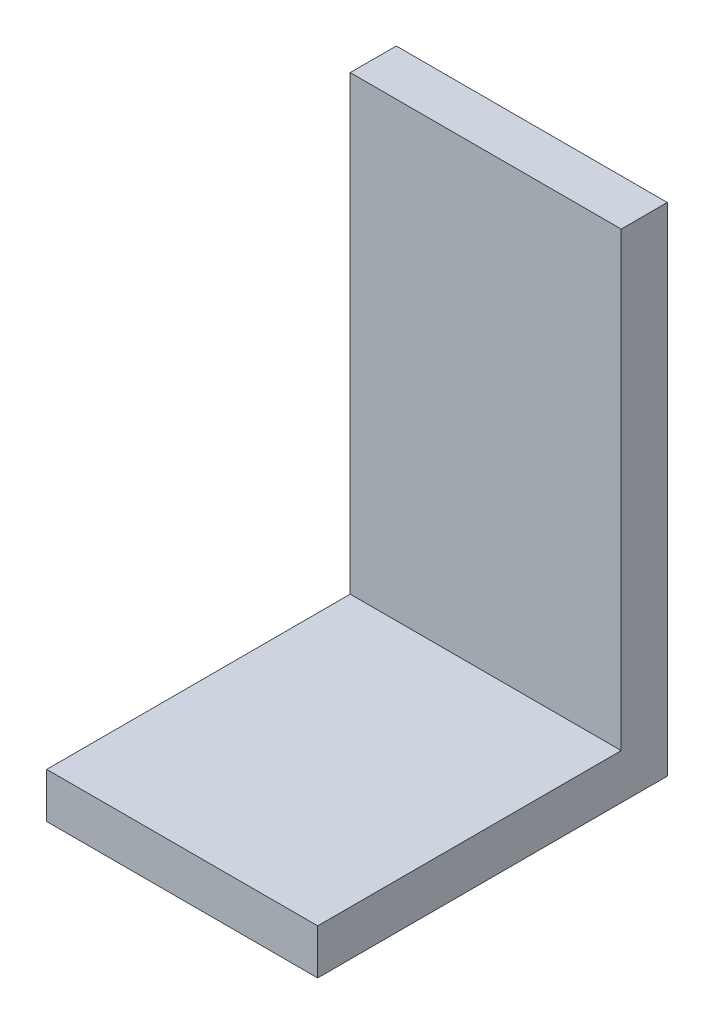
ISO-10303-21;
HEADER;
FILE_DESCRIPTION(('STEP AP214'),'2;1');
FILE_NAME('part.step','',(''),(''),'','','');
FILE_SCHEMA(('AUTOMOTIVE_DESIGN { 1 0 10303 214 1 1 1 1 }'));
ENDSEC;
DATA;
#1=APPLICATION_CONTEXT('core data for automotive mechanical design processes');
#2=APPLICATION_PROTOCOL_DEFINITION('international standard','automotive_design',2000,#1);
#3=PRODUCT_CONTEXT('',#1,'mechanical');
#4=PRODUCT('Part','Part','',(#3));
#5=PRODUCT_RELATED_PRODUCT_CATEGORY('part','',(#4));
#6=PRODUCT_DEFINITION_FORMATION('','',#4);
#7=PRODUCT_DEFINITION_CONTEXT('part definition',#1,'design');
#8=PRODUCT_DEFINITION('design','',#6,#7);
#9=PRODUCT_DEFINITION_SHAPE('','',#8);
#10=(LENGTH_UNIT() NAMED_UNIT(*) SI_UNIT(.MILLI.,.METRE.));
#11=(NAMED_UNIT(*) PLANE_ANGLE_UNIT() SI_UNIT($,.RADIAN.));
#12=(NAMED_UNIT(*) SI_UNIT($,.STERADIAN.) SOLID_ANGLE_UNIT());
#13=UNCERTAINTY_MEASURE_WITH_UNIT(LENGTH_MEASURE(1.E-05),#10,'distance_accuracy_value','');
#14=(GEOMETRIC_REPRESENTATION_CONTEXT(3) GLOBAL_UNCERTAINTY_ASSIGNED_CONTEXT((#13)) GLOBAL_UNIT_ASSIGNED_CONTEXT((#10,
#11,#12)) REPRESENTATION_CONTEXT('',''));
#15=CARTESIAN_POINT('',(0.,0.,0.));
#16=DIRECTION('',(0.,0.,1.));
#17=DIRECTION('',(1.,0.,0.));
#18=AXIS2_PLACEMENT_3D('',#15,#16,#17);
#19=CARTESIAN_POINT('',(-0.6,-4.55,0.));
#20=DIRECTION('',(1.,0.,0.));
#21=DIRECTION('',(0.,0.,1.));
#22=AXIS2_PLACEMENT_3D('',#19,#20,#21);
#23=PLANE('',#22);
#24=DIRECTION('',(0.,-1.,0.));
#25=VECTOR('',#24,1.);
#26=CARTESIAN_POINT('',(-0.6,-4.,0.));
#27=LINE('',#26,#25);
#28=CARTESIAN_POINT('',(-0.6,-4.,0.));
#29=VERTEX_POINT('',#28);
#30=CARTESIAN_POINT('',(-0.6,-4.55,0.));
#31=VERTEX_POINT('',#30);
#32=EDGE_CURVE('E11',#29,#31,#27,.T.);
#33=ORIENTED_EDGE('',*,*,#32,.F.);
#34=DIRECTION('',(0.,0.,-1.));
#35=VECTOR('',#34,1.);
#36=CARTESIAN_POINT('',(-0.6,-4.,0.051));
#37=LINE('',#36,#35);
#38=CARTESIAN_POINT('',(-0.6,-4.,0.051));
#39=VERTEX_POINT('',#38);
#40=EDGE_CURVE('E24',#39,#29,#37,.T.);
#41=ORIENTED_EDGE('',*,*,#40,.F.);
#42=DIRECTION('',(0.,1.,0.));
#43=VECTOR('',#42,1.);
#44=CARTESIAN_POINT('',(-0.6,-4.5,0.051));
#45=LINE('',#44,#43);
#46=CARTESIAN_POINT('',(-0.6,-4.5,0.051));
#47=VERTEX_POINT('',#46);
#48=EDGE_CURVE('E87',#47,#39,#45,.T.);
#49=ORIENTED_EDGE('',*,*,#48,.F.);
#50=DIRECTION('',(0.,0.,-1.));
#51=VECTOR('',#50,1.);
#52=CARTESIAN_POINT('',(-0.6,-4.5,0.387));
#53=LINE('',#52,#51);
#54=CARTESIAN_POINT('',(-0.6,-4.5,0.387));
#55=VERTEX_POINT('',#54);
#56=EDGE_CURVE('E114',#55,#47,#53,.T.);
#57=ORIENTED_EDGE('',*,*,#56,.F.);
#58=DIRECTION('',(0.,1.,0.));
#59=VECTOR('',#58,1.);
#60=CARTESIAN_POINT('',(-0.6,-4.55,0.387));
#61=LINE('',#60,#59);
#62=CARTESIAN_POINT('',(-0.6,-4.55,0.387));
#63=VERTEX_POINT('',#62);
#64=EDGE_CURVE('E111',#63,#55,#61,.T.);
#65=ORIENTED_EDGE('',*,*,#64,.F.);
#66=DIRECTION('',(0.,0.,1.));
#67=VECTOR('',#66,1.);
#68=CARTESIAN_POINT('',(-0.6,-4.55,0.));
#69=LINE('',#68,#67);
#70=EDGE_CURVE('E108',#31,#63,#69,.T.);
#71=ORIENTED_EDGE('',*,*,#70,.F.);
#72=EDGE_LOOP('',(#33,#41,#49,#57,#65,#71));
#73=FACE_BOUND('',#72,.T.);
#74=ADVANCED_FACE('F17',(#73),#23,.T.);
#75=CARTESIAN_POINT('',(-0.9,-4.,0.));
#76=DIRECTION('',(-1.,0.,0.));
#77=DIRECTION('',(0.,0.,1.));
#78=AXIS2_PLACEMENT_3D('',#75,#76,#77);
#79=PLANE('',#78);
#80=DIRECTION('',(0.,1.,0.));
#81=VECTOR('',#80,1.);
#82=CARTESIAN_POINT('',(-0.9,-4.55,0.));
#83=LINE('',#82,#81);
#84=CARTESIAN_POINT('',(-0.9,-4.55,0.));
#85=VERTEX_POINT('',#84);
#86=CARTESIAN_POINT('',(-0.9,-4.,0.));
#87=VERTEX_POINT('',#86);
#88=EDGE_CURVE('E106',#85,#87,#83,.T.);
#89=ORIENTED_EDGE('',*,*,#88,.F.);
#90=DIRECTION('',(0.,0.,-1.));
#91=VECTOR('',#90,1.);
#92=CARTESIAN_POINT('',(-0.9,-4.55,0.387));
#93=LINE('',#92,#91);
#94=CARTESIAN_POINT('',(-0.9,-4.55,0.387));
#95=VERTEX_POINT('',#94);
#96=EDGE_CURVE('E103',#95,#85,#93,.T.);
#97=ORIENTED_EDGE('',*,*,#96,.F.);
#98=DIRECTION('',(0.,-1.,0.));
#99=VECTOR('',#98,1.);
#100=CARTESIAN_POINT('',(-0.9,-4.5,0.387));
#101=LINE('',#100,#99);
#102=CARTESIAN_POINT('',(-0.9,-4.5,0.387));
#103=VERTEX_POINT('',#102);
#104=EDGE_CURVE('E100',#103,#95,#101,.T.);
#105=ORIENTED_EDGE('',*,*,#104,.F.);
#106=DIRECTION('',(0.,0.,1.));
#107=VECTOR('',#106,1.);
#108=CARTESIAN_POINT('',(-0.9,-4.5,0.051));
#109=LINE('',#108,#107);
#110=CARTESIAN_POINT('',(-0.9,-4.5,0.051));
#111=VERTEX_POINT('',#110);
#112=EDGE_CURVE('E72',#111,#103,#109,.T.);
#113=ORIENTED_EDGE('',*,*,#112,.F.);
#114=DIRECTION('',(0.,-1.,0.));
#115=VECTOR('',#114,1.);
#116=CARTESIAN_POINT('',(-0.9,-4.,0.051));
#117=LINE('',#116,#115);
#118=CARTESIAN_POINT('',(-0.9,-4.,0.051));
#119=VERTEX_POINT('',#118);
#120=EDGE_CURVE('E66',#119,#111,#117,.T.);
#121=ORIENTED_EDGE('',*,*,#120,.F.);
#122=DIRECTION('',(0.,0.,1.));
#123=VECTOR('',#122,1.);
#124=CARTESIAN_POINT('',(-0.9,-4.,0.));
#125=LINE('',#124,#123);
#126=EDGE_CURVE('E69',#87,#119,#125,.T.);
#127=ORIENTED_EDGE('',*,*,#126,.F.);
#128=EDGE_LOOP('',(#89,#97,#105,#113,#121,#127));
#129=FACE_BOUND('',#128,.T.);
#130=ADVANCED_FACE('F68',(#129),#79,.T.);
#131=CARTESIAN_POINT('',(-0.6,-4.55,0.387));
#132=DIRECTION('',(0.,0.,1.));
#133=DIRECTION('',(0.,1.,0.));
#134=AXIS2_PLACEMENT_3D('',#131,#132,#133);
#135=PLANE('',#134);
#136=ORIENTED_EDGE('',*,*,#64,.T.);
#137=DIRECTION('',(1.,0.,0.));
#138=VECTOR('',#137,1.);
#139=CARTESIAN_POINT('',(-0.9,-4.5,0.387));
#140=LINE('',#139,#138);
#141=EDGE_CURVE('E83',#103,#55,#140,.T.);
#142=ORIENTED_EDGE('',*,*,#141,.F.);
#143=ORIENTED_EDGE('',*,*,#104,.T.);
#144=DIRECTION('',(-1.,0.,0.));
#145=VECTOR('',#144,1.);
#146=CARTESIAN_POINT('',(-0.6,-4.55,0.387));
#147=LINE('',#146,#145);
#148=EDGE_CURVE('E88',#63,#95,#147,.T.);
#149=ORIENTED_EDGE('',*,*,#148,.F.);
#150=EDGE_LOOP('',(#136,#142,#143,#149));
#151=FACE_BOUND('',#150,.T.);
#152=ADVANCED_FACE('F125',(#151),#135,.T.);
#153=CARTESIAN_POINT('',(-0.6,-4.5,0.051));
#154=DIRECTION('',(0.,0.,1.));
#155=DIRECTION('',(0.,1.,0.));
#156=AXIS2_PLACEMENT_3D('',#153,#154,#155);
#157=PLANE('',#156);
#158=ORIENTED_EDGE('',*,*,#48,.T.);
#159=DIRECTION('',(1.,0.,0.));
#160=VECTOR('',#159,1.);
#161=CARTESIAN_POINT('',(-0.9,-4.,0.051));
#162=LINE('',#161,#160);
#163=EDGE_CURVE('E81',#119,#39,#162,.T.);
#164=ORIENTED_EDGE('',*,*,#163,.F.);
#165=ORIENTED_EDGE('',*,*,#120,.T.);
#166=DIRECTION('',(-1.,0.,0.));
#167=VECTOR('',#166,1.);
#168=CARTESIAN_POINT('',(-0.6,-4.5,0.051));
#169=LINE('',#168,#167);
#170=EDGE_CURVE('E89',#47,#111,#169,.T.);
#171=ORIENTED_EDGE('',*,*,#170,.F.);
#172=EDGE_LOOP('',(#158,#164,#165,#171));
#173=FACE_BOUND('',#172,.T.);
#174=ADVANCED_FACE('F86',(#173),#157,.T.);
#175=CARTESIAN_POINT('',(-0.9,-4.55,0.));
#176=DIRECTION('',(0.,-1.,0.));
#177=DIRECTION('',(0.,0.,1.));
#178=AXIS2_PLACEMENT_3D('',#175,#176,#177);
#179=PLANE('',#178);
#180=DIRECTION('',(-1.,0.,0.));
#181=VECTOR('',#180,1.);
#182=CARTESIAN_POINT('',(-0.6,-4.55,0.));
#183=LINE('',#182,#181);
#184=EDGE_CURVE('E93',#31,#85,#183,.T.);
#185=ORIENTED_EDGE('',*,*,#184,.F.);
#186=ORIENTED_EDGE('',*,*,#70,.T.);
#187=ORIENTED_EDGE('',*,*,#148,.T.);
#188=ORIENTED_EDGE('',*,*,#96,.T.);
#189=EDGE_LOOP('',(#185,#186,#187,#188));
#190=FACE_BOUND('',#189,.T.);
#191=ADVANCED_FACE('F121',(#190),#179,.T.);
#192=CARTESIAN_POINT('',(-0.6,-4.,0.));
#193=DIRECTION('',(0.,1.,0.));
#194=DIRECTION('',(0.,0.,1.));
#195=AXIS2_PLACEMENT_3D('',#192,#193,#194);
#196=PLANE('',#195);
#197=DIRECTION('',(1.,0.,0.));
#198=VECTOR('',#197,1.);
#199=CARTESIAN_POINT('',(-0.9,-4.,0.));
#200=LINE('',#199,#198);
#201=EDGE_CURVE('E82',#87,#29,#200,.T.);
#202=ORIENTED_EDGE('',*,*,#201,.F.);
#203=ORIENTED_EDGE('',*,*,#126,.T.);
#204=ORIENTED_EDGE('',*,*,#163,.T.);
#205=ORIENTED_EDGE('',*,*,#40,.T.);
#206=EDGE_LOOP('',(#202,#203,#204,#205));
#207=FACE_BOUND('',#206,.T.);
#208=ADVANCED_FACE('F80',(#207),#196,.T.);
#209=CARTESIAN_POINT('',(-0.6,-4.5,0.051));
#210=DIRECTION('',(0.,1.,0.));
#211=DIRECTION('',(0.,0.,1.));
#212=AXIS2_PLACEMENT_3D('',#209,#210,#211);
#213=PLANE('',#212);
#214=ORIENTED_EDGE('',*,*,#170,.T.);
#215=ORIENTED_EDGE('',*,*,#112,.T.);
#216=ORIENTED_EDGE('',*,*,#141,.T.);
#217=ORIENTED_EDGE('',*,*,#56,.T.);
#218=EDGE_LOOP('',(#214,#215,#216,#217));
#219=FACE_BOUND('',#218,.T.);
#220=ADVANCED_FACE('F127',(#219),#213,.T.);
#221=CARTESIAN_POINT('',(-0.9,-4.55,0.));
#222=DIRECTION('',(0.,0.,-1.));
#223=DIRECTION('',(0.,1.,0.));
#224=AXIS2_PLACEMENT_3D('',#221,#222,#223);
#225=PLANE('',#224);
#226=ORIENTED_EDGE('',*,*,#88,.T.);
#227=ORIENTED_EDGE('',*,*,#201,.T.);
#228=ORIENTED_EDGE('',*,*,#32,.T.);
#229=ORIENTED_EDGE('',*,*,#184,.T.);
#230=EDGE_LOOP('',(#226,#227,#228,#229));
#231=FACE_BOUND('',#230,.T.);
#232=ADVANCED_FACE('F117',(#231),#225,.T.);
#233=CLOSED_SHELL('',(#74,#130,#152,#174,#191,#208,#220,#232));
#234=MANIFOLD_SOLID_BREP('B1',#233);
#235=ADVANCED_BREP_SHAPE_REPRESENTATION('',(#18,#234),#14);
#236=SHAPE_DEFINITION_REPRESENTATION(#9,#235);
ENDSEC;
END-ISO-10303-21;
